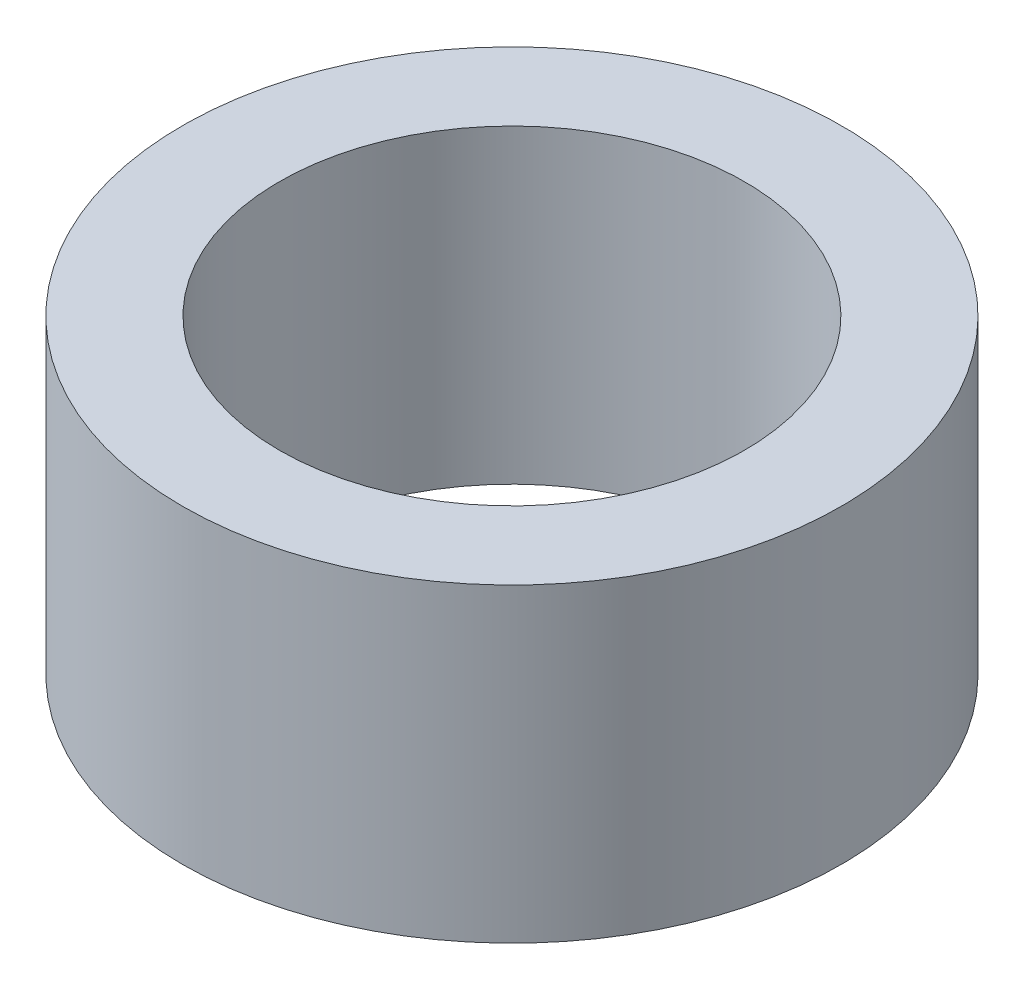
ISO-10303-21;
HEADER;
FILE_DESCRIPTION(('STEP AP214'),'2;1');
FILE_NAME('part.step','',(''),(''),'','','');
FILE_SCHEMA(('AUTOMOTIVE_DESIGN { 1 0 10303 214 1 1 1 1 }'));
ENDSEC;
DATA;
#1=APPLICATION_CONTEXT('core data for automotive mechanical design processes');
#2=APPLICATION_PROTOCOL_DEFINITION('international standard','automotive_design',2000,#1);
#3=PRODUCT_CONTEXT('',#1,'mechanical');
#4=PRODUCT('Part','Part','',(#3));
#5=PRODUCT_RELATED_PRODUCT_CATEGORY('part','',(#4));
#6=PRODUCT_DEFINITION_FORMATION('','',#4);
#7=PRODUCT_DEFINITION_CONTEXT('part definition',#1,'design');
#8=PRODUCT_DEFINITION('design','',#6,#7);
#9=PRODUCT_DEFINITION_SHAPE('','',#8);
#10=(LENGTH_UNIT() NAMED_UNIT(*) SI_UNIT(.MILLI.,.METRE.));
#11=(NAMED_UNIT(*) PLANE_ANGLE_UNIT() SI_UNIT($,.RADIAN.));
#12=(NAMED_UNIT(*) SI_UNIT($,.STERADIAN.) SOLID_ANGLE_UNIT());
#13=UNCERTAINTY_MEASURE_WITH_UNIT(LENGTH_MEASURE(1.E-05),#10,'distance_accuracy_value','');
#14=(GEOMETRIC_REPRESENTATION_CONTEXT(3) GLOBAL_UNCERTAINTY_ASSIGNED_CONTEXT((#13)) GLOBAL_UNIT_ASSIGNED_CONTEXT((#10,
#11,#12)) REPRESENTATION_CONTEXT('',''));
#15=CARTESIAN_POINT('',(0.,0.,0.));
#16=DIRECTION('',(0.,0.,1.));
#17=DIRECTION('',(1.,0.,0.));
#18=AXIS2_PLACEMENT_3D('',#15,#16,#17);
#19=CARTESIAN_POINT('',(0.,40.,0.));
#20=DIRECTION('',(0.,1.,0.));
#21=DIRECTION('',(0.,0.,1.));
#22=AXIS2_PLACEMENT_3D('',#19,#20,#21);
#23=PLANE('',#22);
#24=CARTESIAN_POINT('',(0.,40.,0.));
#25=DIRECTION('',(0.,1.,0.));
#26=DIRECTION('',(0.,0.,1.));
#27=AXIS2_PLACEMENT_3D('',#24,#25,#26);
#28=CIRCLE('',#27,42.5);
#29=CARTESIAN_POINT('',(0.,40.,42.5));
#30=VERTEX_POINT('',#29);
#31=EDGE_CURVE('E10',#30,#30,#28,.T.);
#32=ORIENTED_EDGE('',*,*,#31,.T.);
#33=EDGE_LOOP('',(#32));
#34=FACE_BOUND('',#33,.T.);
#35=CARTESIAN_POINT('',(0.,40.,0.));
#36=DIRECTION('',(0.,1.,0.));
#37=DIRECTION('',(0.,0.,1.));
#38=AXIS2_PLACEMENT_3D('',#35,#36,#37);
#39=CIRCLE('',#38,30.);
#40=CARTESIAN_POINT('',(0.,40.,30.));
#41=VERTEX_POINT('',#40);
#42=EDGE_CURVE('E50',#41,#41,#39,.T.);
#43=ORIENTED_EDGE('',*,*,#42,.F.);
#44=EDGE_LOOP('',(#43));
#45=FACE_BOUND('',#44,.T.);
#46=ADVANCED_FACE('F37',(#34,#45),#23,.T.);
#47=CARTESIAN_POINT('',(0.,0.,0.));
#48=DIRECTION('',(0.,1.,0.));
#49=DIRECTION('',(0.,0.,1.));
#50=AXIS2_PLACEMENT_3D('',#47,#48,#49);
#51=PLANE('',#50);
#52=CARTESIAN_POINT('',(0.,0.,0.));
#53=DIRECTION('',(0.,1.,0.));
#54=DIRECTION('',(0.,0.,1.));
#55=AXIS2_PLACEMENT_3D('',#52,#53,#54);
#56=CIRCLE('',#55,42.5);
#57=CARTESIAN_POINT('',(0.,0.,42.5));
#58=VERTEX_POINT('',#57);
#59=EDGE_CURVE('E41',#58,#58,#56,.T.);
#60=ORIENTED_EDGE('',*,*,#59,.F.);
#61=EDGE_LOOP('',(#60));
#62=FACE_BOUND('',#61,.T.);
#63=CARTESIAN_POINT('',(0.,0.,0.));
#64=DIRECTION('',(0.,1.,0.));
#65=DIRECTION('',(0.,0.,1.));
#66=AXIS2_PLACEMENT_3D('',#63,#64,#65);
#67=CIRCLE('',#66,30.);
#68=CARTESIAN_POINT('',(0.,0.,30.));
#69=VERTEX_POINT('',#68);
#70=EDGE_CURVE('E52',#69,#69,#67,.T.);
#71=ORIENTED_EDGE('',*,*,#70,.T.);
#72=EDGE_LOOP('',(#71));
#73=FACE_BOUND('',#72,.T.);
#74=ADVANCED_FACE('F64',(#62,#73),#51,.F.);
#75=CARTESIAN_POINT('',(0.,40.,0.));
#76=DIRECTION('',(0.,-1.,0.));
#77=DIRECTION('',(0.,0.,-1.));
#78=AXIS2_PLACEMENT_3D('',#75,#76,#77);
#79=CYLINDRICAL_SURFACE('',#78,42.5);
#80=ORIENTED_EDGE('',*,*,#31,.F.);
#81=EDGE_LOOP('',(#80));
#82=FACE_BOUND('',#81,.T.);
#83=ORIENTED_EDGE('',*,*,#59,.T.);
#84=EDGE_LOOP('',(#83));
#85=FACE_BOUND('',#84,.T.);
#86=ADVANCED_FACE('F39',(#82,#85),#79,.T.);
#87=CARTESIAN_POINT('',(0.,40.,0.));
#88=DIRECTION('',(0.,-1.,0.));
#89=DIRECTION('',(0.,0.,-1.));
#90=AXIS2_PLACEMENT_3D('',#87,#88,#89);
#91=CYLINDRICAL_SURFACE('',#90,30.);
#92=ORIENTED_EDGE('',*,*,#42,.T.);
#93=EDGE_LOOP('',(#92));
#94=FACE_BOUND('',#93,.T.);
#95=ORIENTED_EDGE('',*,*,#70,.F.);
#96=EDGE_LOOP('',(#95));
#97=FACE_BOUND('',#96,.T.);
#98=ADVANCED_FACE('F60',(#94,#97),#91,.F.);
#99=CLOSED_SHELL('',(#46,#74,#86,#98));
#100=MANIFOLD_SOLID_BREP('B2',#99);
#101=ADVANCED_BREP_SHAPE_REPRESENTATION('',(#18,#100),#14);
#102=SHAPE_DEFINITION_REPRESENTATION(#9,#101);
ENDSEC;
END-ISO-10303-21;
